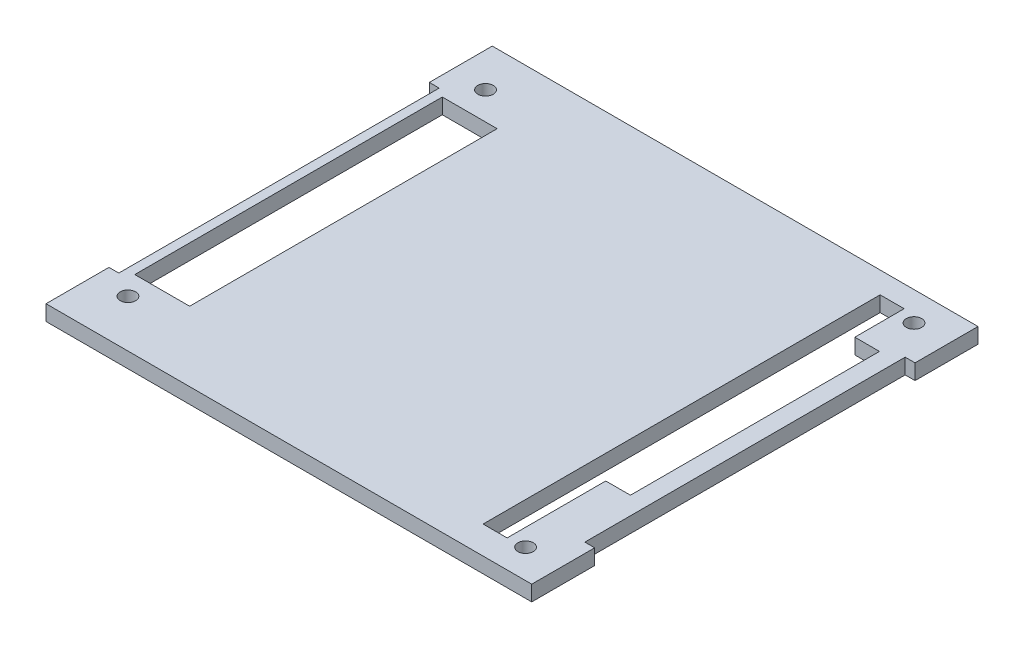
ISO-10303-21;
HEADER;
FILE_DESCRIPTION(('STEP AP214'),'2;1');
FILE_NAME('part.step','',(''),(''),'','','');
FILE_SCHEMA(('AUTOMOTIVE_DESIGN { 1 0 10303 214 1 1 1 1 }'));
ENDSEC;
DATA;
#1=APPLICATION_CONTEXT('core data for automotive mechanical design processes');
#2=APPLICATION_PROTOCOL_DEFINITION('international standard','automotive_design',2000,#1);
#3=PRODUCT_CONTEXT('',#1,'mechanical');
#4=PRODUCT('Part','Part','',(#3));
#5=PRODUCT_RELATED_PRODUCT_CATEGORY('part','',(#4));
#6=PRODUCT_DEFINITION_FORMATION('','',#4);
#7=PRODUCT_DEFINITION_CONTEXT('part definition',#1,'design');
#8=PRODUCT_DEFINITION('design','',#6,#7);
#9=PRODUCT_DEFINITION_SHAPE('','',#8);
#10=(LENGTH_UNIT() NAMED_UNIT(*) SI_UNIT(.MILLI.,.METRE.));
#11=(NAMED_UNIT(*) PLANE_ANGLE_UNIT() SI_UNIT($,.RADIAN.));
#12=(NAMED_UNIT(*) SI_UNIT($,.STERADIAN.) SOLID_ANGLE_UNIT());
#13=UNCERTAINTY_MEASURE_WITH_UNIT(LENGTH_MEASURE(1.E-05),#10,'distance_accuracy_value','');
#14=(GEOMETRIC_REPRESENTATION_CONTEXT(3) GLOBAL_UNCERTAINTY_ASSIGNED_CONTEXT((#13)) GLOBAL_UNIT_ASSIGNED_CONTEXT((#10,
#11,#12)) REPRESENTATION_CONTEXT('',''));
#15=CARTESIAN_POINT('',(0.,0.,0.));
#16=DIRECTION('',(0.,0.,1.));
#17=DIRECTION('',(1.,0.,0.));
#18=AXIS2_PLACEMENT_3D('',#15,#16,#17);
#19=CARTESIAN_POINT('',(0.,1.5875,0.));
#20=DIRECTION('',(0.,1.,0.));
#21=DIRECTION('',(0.,0.,1.));
#22=AXIS2_PLACEMENT_3D('',#19,#20,#21);
#23=PLANE('',#22);
#24=CARTESIAN_POINT('',(40.77835,1.5875,-40.005));
#25=DIRECTION('',(0.,1.,0.));
#26=DIRECTION('',(0.,0.,1.));
#27=AXIS2_PLACEMENT_3D('',#24,#25,#26);
#28=CIRCLE('',#27,1.59);
#29=CARTESIAN_POINT('',(40.77835,1.5875,-38.415));
#30=VERTEX_POINT('',#29);
#31=EDGE_CURVE('E839',#30,#30,#28,.T.);
#32=ORIENTED_EDGE('',*,*,#31,.F.);
#33=EDGE_LOOP('',(#32));
#34=FACE_BOUND('',#33,.T.);
#35=CARTESIAN_POINT('',(40.77835,1.5875,40.005));
#36=DIRECTION('',(0.,1.,0.));
#37=DIRECTION('',(0.,0.,1.));
#38=AXIS2_PLACEMENT_3D('',#35,#36,#37);
#39=CIRCLE('',#38,1.59);
#40=CARTESIAN_POINT('',(40.77835,1.5875,41.595));
#41=VERTEX_POINT('',#40);
#42=EDGE_CURVE('E843',#41,#41,#39,.T.);
#43=ORIENTED_EDGE('',*,*,#42,.F.);
#44=EDGE_LOOP('',(#43));
#45=FACE_BOUND('',#44,.T.);
#46=DIRECTION('',(1.,0.,0.));
#47=VECTOR('',#46,1.);
#48=CARTESIAN_POINT('',(0.,1.5875,40.255));
#49=LINE('',#48,#47);
#50=CARTESIAN_POINT('',(32.26835,1.5875,40.255));
#51=VERTEX_POINT('',#50);
#52=CARTESIAN_POINT('',(37.21835,1.5875,40.255));
#53=VERTEX_POINT('',#52);
#54=EDGE_CURVE('E141',#51,#53,#49,.T.);
#55=ORIENTED_EDGE('',*,*,#54,.F.);
#56=DIRECTION('',(0.,0.,1.));
#57=VECTOR('',#56,1.);
#58=CARTESIAN_POINT('',(32.26835,1.5875,0.));
#59=LINE('',#58,#57);
#60=CARTESIAN_POINT('',(32.26835,1.5875,-41.535));
#61=VERTEX_POINT('',#60);
#62=EDGE_CURVE('E858',#61,#51,#59,.T.);
#63=ORIENTED_EDGE('',*,*,#62,.F.);
#64=DIRECTION('',(-1.,0.,0.));
#65=VECTOR('',#64,1.);
#66=CARTESIAN_POINT('',(0.,1.5875,-41.535));
#67=LINE('',#66,#65);
#68=CARTESIAN_POINT('',(37.21835,1.5875,-41.535));
#69=VERTEX_POINT('',#68);
#70=EDGE_CURVE('E868',#69,#61,#67,.T.);
#71=ORIENTED_EDGE('',*,*,#70,.F.);
#72=DIRECTION('',(0.,0.,-1.));
#73=VECTOR('',#72,1.);
#74=CARTESIAN_POINT('',(37.21835,1.5875,0.));
#75=LINE('',#74,#73);
#76=CARTESIAN_POINT('',(37.21835,1.5875,-31.375));
#77=VERTEX_POINT('',#76);
#78=EDGE_CURVE('E871',#77,#69,#75,.T.);
#79=ORIENTED_EDGE('',*,*,#78,.F.);
#80=DIRECTION('',(-1.,0.,0.));
#81=VECTOR('',#80,1.);
#82=CARTESIAN_POINT('',(0.,1.5875,-31.375));
#83=LINE('',#82,#81);
#84=CARTESIAN_POINT('',(42.29835,1.5875,-31.375));
#85=VERTEX_POINT('',#84);
#86=EDGE_CURVE('E874',#85,#77,#83,.T.);
#87=ORIENTED_EDGE('',*,*,#86,.F.);
#88=DIRECTION('',(0.,0.,-1.));
#89=VECTOR('',#88,1.);
#90=CARTESIAN_POINT('',(42.29835,1.5875,0.));
#91=LINE('',#90,#89);
#92=CARTESIAN_POINT('',(42.29835,1.5875,19.935));
#93=VERTEX_POINT('',#92);
#94=EDGE_CURVE('E877',#93,#85,#91,.T.);
#95=ORIENTED_EDGE('',*,*,#94,.F.);
#96=DIRECTION('',(1.,0.,0.));
#97=VECTOR('',#96,1.);
#98=CARTESIAN_POINT('',(0.,1.5875,19.935));
#99=LINE('',#98,#97);
#100=CARTESIAN_POINT('',(37.21835,1.5875,19.935));
#101=VERTEX_POINT('',#100);
#102=EDGE_CURVE('E306',#101,#93,#99,.T.);
#103=ORIENTED_EDGE('',*,*,#102,.F.);
#104=DIRECTION('',(0.,0.,-1.));
#105=VECTOR('',#104,1.);
#106=CARTESIAN_POINT('',(37.21835,1.5875,0.));
#107=LINE('',#106,#105);
#108=EDGE_CURVE('E880',#53,#101,#107,.T.);
#109=ORIENTED_EDGE('',*,*,#108,.F.);
#110=EDGE_LOOP('',(#55,#63,#71,#79,#87,#95,#103,#109));
#111=FACE_BOUND('',#110,.T.);
#112=CARTESIAN_POINT('',(-44.95165,1.5875,-37.465));
#113=DIRECTION('',(0.,1.,0.));
#114=DIRECTION('',(0.,0.,1.));
#115=AXIS2_PLACEMENT_3D('',#112,#113,#114);
#116=CIRCLE('',#115,1.59);
#117=CARTESIAN_POINT('',(-44.95165,1.5875,-35.875));
#118=VERTEX_POINT('',#117);
#119=EDGE_CURVE('E336',#118,#118,#116,.T.);
#120=ORIENTED_EDGE('',*,*,#119,.F.);
#121=EDGE_LOOP('',(#120));
#122=FACE_BOUND('',#121,.T.);
#123=CARTESIAN_POINT('',(-44.95165,1.5875,36.195));
#124=DIRECTION('',(0.,1.,0.));
#125=DIRECTION('',(0.,0.,1.));
#126=AXIS2_PLACEMENT_3D('',#123,#124,#125);
#127=CIRCLE('',#126,1.59);
#128=CARTESIAN_POINT('',(-44.95165,1.5875,37.785));
#129=VERTEX_POINT('',#128);
#130=EDGE_CURVE('E845',#129,#129,#127,.T.);
#131=ORIENTED_EDGE('',*,*,#130,.F.);
#132=EDGE_LOOP('',(#131));
#133=FACE_BOUND('',#132,.T.);
#134=DIRECTION('',(1.,0.,0.));
#135=VECTOR('',#134,1.);
#136=CARTESIAN_POINT('',(0.,1.5875,-45.9682931399924));
#137=LINE('',#136,#135);
#138=CARTESIAN_POINT('',(-52.06365,1.5875,-45.9682931399924));
#139=VERTEX_POINT('',#138);
#140=CARTESIAN_POINT('',(48.00035,1.5875,-45.9682931399924));
#141=VERTEX_POINT('',#140);
#142=EDGE_CURVE('E353',#139,#141,#137,.T.);
#143=ORIENTED_EDGE('',*,*,#142,.F.);
#144=DIRECTION('',(0.,0.,1.));
#145=VECTOR('',#144,1.);
#146=CARTESIAN_POINT('',(-52.06365,1.5875,0.));
#147=LINE('',#146,#145);
#148=CARTESIAN_POINT('',(-52.06365,1.5875,-33.0002931399924));
#149=VERTEX_POINT('',#148);
#150=EDGE_CURVE('E356',#139,#149,#147,.T.);
#151=ORIENTED_EDGE('',*,*,#150,.T.);
#152=DIRECTION('',(1.,0.,0.));
#153=VECTOR('',#152,1.);
#154=CARTESIAN_POINT('',(0.,1.5875,-33.0002931399924));
#155=LINE('',#154,#153);
#156=CARTESIAN_POINT('',(-50.03165,1.5875,-33.0002931399924));
#157=VERTEX_POINT('',#156);
#158=EDGE_CURVE('E359',#149,#157,#155,.T.);
#159=ORIENTED_EDGE('',*,*,#158,.T.);
#160=DIRECTION('',(0.,0.,-1.));
#161=VECTOR('',#160,1.);
#162=CARTESIAN_POINT('',(-50.03165,1.5875,0.));
#163=LINE('',#162,#161);
#164=CARTESIAN_POINT('',(-50.03165,1.5875,32.9997068600076));
#165=VERTEX_POINT('',#164);
#166=EDGE_CURVE('E361',#165,#157,#163,.T.);
#167=ORIENTED_EDGE('',*,*,#166,.F.);
#168=DIRECTION('',(-1.,0.,0.));
#169=VECTOR('',#168,1.);
#170=CARTESIAN_POINT('',(0.,1.5875,32.9997068600076));
#171=LINE('',#170,#169);
#172=CARTESIAN_POINT('',(-52.06365,1.5875,32.9997068600076));
#173=VERTEX_POINT('',#172);
#174=EDGE_CURVE('E364',#165,#173,#171,.T.);
#175=ORIENTED_EDGE('',*,*,#174,.T.);
#176=DIRECTION('',(0.,0.,1.));
#177=VECTOR('',#176,1.);
#178=CARTESIAN_POINT('',(-52.06365,1.5875,0.));
#179=LINE('',#178,#177);
#180=CARTESIAN_POINT('',(-52.06365,1.5875,45.9677068600076));
#181=VERTEX_POINT('',#180);
#182=EDGE_CURVE('E366',#173,#181,#179,.T.);
#183=ORIENTED_EDGE('',*,*,#182,.T.);
#184=DIRECTION('',(1.,0.,0.));
#185=VECTOR('',#184,1.);
#186=CARTESIAN_POINT('',(0.,1.5875,45.9677068600076));
#187=LINE('',#186,#185);
#188=CARTESIAN_POINT('',(48.00035,1.5875,45.9677068600076));
#189=VERTEX_POINT('',#188);
#190=EDGE_CURVE('E368',#181,#189,#187,.T.);
#191=ORIENTED_EDGE('',*,*,#190,.T.);
#192=DIRECTION('',(0.,0.,-1.));
#193=VECTOR('',#192,1.);
#194=CARTESIAN_POINT('',(48.00035,1.5875,0.));
#195=LINE('',#194,#193);
#196=CARTESIAN_POINT('',(48.00035,1.5875,32.9997068600076));
#197=VERTEX_POINT('',#196);
#198=EDGE_CURVE('E370',#189,#197,#195,.T.);
#199=ORIENTED_EDGE('',*,*,#198,.T.);
#200=DIRECTION('',(-1.,0.,0.));
#201=VECTOR('',#200,1.);
#202=CARTESIAN_POINT('',(0.,1.5875,32.9997068600076));
#203=LINE('',#202,#201);
#204=CARTESIAN_POINT('',(45.96835,1.5875,32.9997068600076));
#205=VERTEX_POINT('',#204);
#206=EDGE_CURVE('E372',#197,#205,#203,.T.);
#207=ORIENTED_EDGE('',*,*,#206,.T.);
#208=DIRECTION('',(0.,0.,-1.));
#209=VECTOR('',#208,1.);
#210=CARTESIAN_POINT('',(45.96835,1.5875,0.));
#211=LINE('',#210,#209);
#212=CARTESIAN_POINT('',(45.96835,1.5875,-33.0002931399924));
#213=VERTEX_POINT('',#212);
#214=EDGE_CURVE('E374',#205,#213,#211,.T.);
#215=ORIENTED_EDGE('',*,*,#214,.T.);
#216=DIRECTION('',(1.,0.,0.));
#217=VECTOR('',#216,1.);
#218=CARTESIAN_POINT('',(0.,1.5875,-33.0002931399924));
#219=LINE('',#218,#217);
#220=CARTESIAN_POINT('',(48.00035,1.5875,-33.0002931399924));
#221=VERTEX_POINT('',#220);
#222=EDGE_CURVE('E376',#213,#221,#219,.T.);
#223=ORIENTED_EDGE('',*,*,#222,.T.);
#224=DIRECTION('',(0.,0.,-1.));
#225=VECTOR('',#224,1.);
#226=CARTESIAN_POINT('',(48.00035,1.5875,0.));
#227=LINE('',#226,#225);
#228=EDGE_CURVE('E378',#221,#141,#227,.T.);
#229=ORIENTED_EDGE('',*,*,#228,.T.);
#230=EDGE_LOOP('',(#143,#151,#159,#167,#175,#183,#191,#199,#207,#215,#223,#229));
#231=FACE_BOUND('',#230,.T.);
#232=DIRECTION('',(-1.,0.,0.));
#233=VECTOR('',#232,1.);
#234=CARTESIAN_POINT('',(0.,1.5875,31.62));
#235=LINE('',#234,#233);
#236=CARTESIAN_POINT('',(-36.82165,1.5875,31.62));
#237=VERTEX_POINT('',#236);
#238=CARTESIAN_POINT('',(-48.12165,1.5875,31.62));
#239=VERTEX_POINT('',#238);
#240=EDGE_CURVE('E339',#237,#239,#235,.T.);
#241=ORIENTED_EDGE('',*,*,#240,.T.);
#242=DIRECTION('',(0.,0.,-1.));
#243=VECTOR('',#242,1.);
#244=CARTESIAN_POINT('',(-48.12165,1.5875,0.));
#245=LINE('',#244,#243);
#246=CARTESIAN_POINT('',(-48.12165,1.5875,-31.73));
#247=VERTEX_POINT('',#246);
#248=EDGE_CURVE('E335',#239,#247,#245,.T.);
#249=ORIENTED_EDGE('',*,*,#248,.T.);
#250=DIRECTION('',(1.,0.,0.));
#251=VECTOR('',#250,1.);
#252=CARTESIAN_POINT('',(0.,1.5875,-31.73));
#253=LINE('',#252,#251);
#254=CARTESIAN_POINT('',(-36.82165,1.5875,-31.73));
#255=VERTEX_POINT('',#254);
#256=EDGE_CURVE('E332',#247,#255,#253,.T.);
#257=ORIENTED_EDGE('',*,*,#256,.T.);
#258=DIRECTION('',(0.,0.,1.));
#259=VECTOR('',#258,1.);
#260=CARTESIAN_POINT('',(-36.82165,1.5875,0.));
#261=LINE('',#260,#259);
#262=EDGE_CURVE('E149',#255,#237,#261,.T.);
#263=ORIENTED_EDGE('',*,*,#262,.T.);
#264=EDGE_LOOP('',(#241,#249,#257,#263));
#265=FACE_BOUND('',#264,.T.);
#266=ADVANCED_FACE('F126',(#34,#45,#111,#122,#133,#231,#265),#23,.T.);
#267=CARTESIAN_POINT('',(0.,-1.5875,0.));
#268=DIRECTION('',(0.,1.,0.));
#269=DIRECTION('',(0.,0.,1.));
#270=AXIS2_PLACEMENT_3D('',#267,#268,#269);
#271=PLANE('',#270);
#272=CARTESIAN_POINT('',(40.77835,-1.58750000000001,-40.005));
#273=DIRECTION('',(0.,1.,0.));
#274=DIRECTION('',(0.,0.,1.));
#275=AXIS2_PLACEMENT_3D('',#272,#273,#274);
#276=CIRCLE('',#275,1.59);
#277=CARTESIAN_POINT('',(40.77835,-1.58750000000001,-38.415));
#278=VERTEX_POINT('',#277);
#279=EDGE_CURVE('E837',#278,#278,#276,.F.);
#280=ORIENTED_EDGE('',*,*,#279,.F.);
#281=EDGE_LOOP('',(#280));
#282=FACE_BOUND('',#281,.T.);
#283=CARTESIAN_POINT('',(40.77835,-1.58750000000001,40.005));
#284=DIRECTION('',(0.,1.,0.));
#285=DIRECTION('',(0.,0.,1.));
#286=AXIS2_PLACEMENT_3D('',#283,#284,#285);
#287=CIRCLE('',#286,1.59);
#288=CARTESIAN_POINT('',(40.77835,-1.58750000000001,41.595));
#289=VERTEX_POINT('',#288);
#290=EDGE_CURVE('E840',#289,#289,#287,.F.);
#291=ORIENTED_EDGE('',*,*,#290,.F.);
#292=EDGE_LOOP('',(#291));
#293=FACE_BOUND('',#292,.T.);
#294=DIRECTION('',(0.,0.,-1.));
#295=VECTOR('',#294,1.);
#296=CARTESIAN_POINT('',(32.26835,-1.58750000000001,0.));
#297=LINE('',#296,#295);
#298=CARTESIAN_POINT('',(32.26835,-1.58750000000001,40.255));
#299=VERTEX_POINT('',#298);
#300=CARTESIAN_POINT('',(32.26835,-1.58750000000001,-41.535));
#301=VERTEX_POINT('',#300);
#302=EDGE_CURVE('E885',#299,#301,#297,.T.);
#303=ORIENTED_EDGE('',*,*,#302,.F.);
#304=DIRECTION('',(-1.,0.,0.));
#305=VECTOR('',#304,1.);
#306=CARTESIAN_POINT('',(0.,-1.58750000000001,40.255));
#307=LINE('',#306,#305);
#308=CARTESIAN_POINT('',(37.21835,-1.58750000000001,40.255));
#309=VERTEX_POINT('',#308);
#310=EDGE_CURVE('E855',#309,#299,#307,.T.);
#311=ORIENTED_EDGE('',*,*,#310,.F.);
#312=DIRECTION('',(0.,0.,1.));
#313=VECTOR('',#312,1.);
#314=CARTESIAN_POINT('',(37.21835,-1.58750000000001,0.));
#315=LINE('',#314,#313);
#316=CARTESIAN_POINT('',(37.21835,-1.5875,19.935));
#317=VERTEX_POINT('',#316);
#318=EDGE_CURVE('E314',#317,#309,#315,.T.);
#319=ORIENTED_EDGE('',*,*,#318,.F.);
#320=DIRECTION('',(-1.,0.,0.));
#321=VECTOR('',#320,1.);
#322=CARTESIAN_POINT('',(0.,-1.58750000000001,19.935));
#323=LINE('',#322,#321);
#324=CARTESIAN_POINT('',(42.29835,-1.58750000000001,19.935));
#325=VERTEX_POINT('',#324);
#326=EDGE_CURVE('E298',#325,#317,#323,.T.);
#327=ORIENTED_EDGE('',*,*,#326,.F.);
#328=DIRECTION('',(0.,0.,1.));
#329=VECTOR('',#328,1.);
#330=CARTESIAN_POINT('',(42.29835,-1.58750000000001,0.));
#331=LINE('',#330,#329);
#332=CARTESIAN_POINT('',(42.29835,-1.58750000000001,-31.375));
#333=VERTEX_POINT('',#332);
#334=EDGE_CURVE('E288',#333,#325,#331,.T.);
#335=ORIENTED_EDGE('',*,*,#334,.F.);
#336=DIRECTION('',(1.,0.,0.));
#337=VECTOR('',#336,1.);
#338=CARTESIAN_POINT('',(0.,-1.58750000000001,-31.375));
#339=LINE('',#338,#337);
#340=CARTESIAN_POINT('',(37.21835,-1.58750000000001,-31.375));
#341=VERTEX_POINT('',#340);
#342=EDGE_CURVE('E299',#341,#333,#339,.T.);
#343=ORIENTED_EDGE('',*,*,#342,.F.);
#344=DIRECTION('',(0.,0.,1.));
#345=VECTOR('',#344,1.);
#346=CARTESIAN_POINT('',(37.21835,-1.58750000000001,0.));
#347=LINE('',#346,#345);
#348=CARTESIAN_POINT('',(37.21835,-1.58750000000001,-41.535));
#349=VERTEX_POINT('',#348);
#350=EDGE_CURVE('E889',#349,#341,#347,.T.);
#351=ORIENTED_EDGE('',*,*,#350,.F.);
#352=DIRECTION('',(1.,0.,0.));
#353=VECTOR('',#352,1.);
#354=CARTESIAN_POINT('',(0.,-1.58750000000001,-41.535));
#355=LINE('',#354,#353);
#356=EDGE_CURVE('E887',#301,#349,#355,.T.);
#357=ORIENTED_EDGE('',*,*,#356,.F.);
#358=EDGE_LOOP('',(#303,#311,#319,#327,#335,#343,#351,#357));
#359=FACE_BOUND('',#358,.T.);
#360=CARTESIAN_POINT('',(-44.95165,-1.58750000000001,-37.465));
#361=DIRECTION('',(0.,1.,0.));
#362=DIRECTION('',(0.,0.,1.));
#363=AXIS2_PLACEMENT_3D('',#360,#361,#362);
#364=CIRCLE('',#363,1.59);
#365=CARTESIAN_POINT('',(-44.95165,-1.58750000000001,-35.875));
#366=VERTEX_POINT('',#365);
#367=EDGE_CURVE('E849',#366,#366,#364,.F.);
#368=ORIENTED_EDGE('',*,*,#367,.F.);
#369=EDGE_LOOP('',(#368));
#370=FACE_BOUND('',#369,.T.);
#371=CARTESIAN_POINT('',(-44.95165,-1.58750000000001,36.195));
#372=DIRECTION('',(0.,1.,0.));
#373=DIRECTION('',(0.,0.,1.));
#374=AXIS2_PLACEMENT_3D('',#371,#372,#373);
#375=CIRCLE('',#374,1.59);
#376=CARTESIAN_POINT('',(-44.95165,-1.58750000000001,37.785));
#377=VERTEX_POINT('',#376);
#378=EDGE_CURVE('E908',#377,#377,#375,.F.);
#379=ORIENTED_EDGE('',*,*,#378,.F.);
#380=EDGE_LOOP('',(#379));
#381=FACE_BOUND('',#380,.T.);
#382=DIRECTION('',(1.,0.,0.));
#383=VECTOR('',#382,1.);
#384=CARTESIAN_POINT('',(0.,-1.5875,-45.9682931399924));
#385=LINE('',#384,#383);
#386=CARTESIAN_POINT('',(-52.06365,-1.5875,-45.9682931399924));
#387=VERTEX_POINT('',#386);
#388=CARTESIAN_POINT('',(48.00035,-1.5875,-45.9682931399924));
#389=VERTEX_POINT('',#388);
#390=EDGE_CURVE('E331',#387,#389,#385,.T.);
#391=ORIENTED_EDGE('',*,*,#390,.T.);
#392=DIRECTION('',(0.,0.,-1.));
#393=VECTOR('',#392,1.);
#394=CARTESIAN_POINT('',(48.00035,-1.5875,0.));
#395=LINE('',#394,#393);
#396=CARTESIAN_POINT('',(48.00035,-1.5875,-33.0002931399924));
#397=VERTEX_POINT('',#396);
#398=EDGE_CURVE('E357',#397,#389,#395,.T.);
#399=ORIENTED_EDGE('',*,*,#398,.F.);
#400=DIRECTION('',(1.,0.,0.));
#401=VECTOR('',#400,1.);
#402=CARTESIAN_POINT('',(0.,-1.5875,-33.0002931399924));
#403=LINE('',#402,#401);
#404=CARTESIAN_POINT('',(45.96835,-1.5875,-33.0002931399924));
#405=VERTEX_POINT('',#404);
#406=EDGE_CURVE('E403',#405,#397,#403,.T.);
#407=ORIENTED_EDGE('',*,*,#406,.F.);
#408=DIRECTION('',(0.,0.,-1.));
#409=VECTOR('',#408,1.);
#410=CARTESIAN_POINT('',(45.96835,-1.5875,0.));
#411=LINE('',#410,#409);
#412=CARTESIAN_POINT('',(45.96835,-1.5875,32.9997068600076));
#413=VERTEX_POINT('',#412);
#414=EDGE_CURVE('E401',#413,#405,#411,.T.);
#415=ORIENTED_EDGE('',*,*,#414,.F.);
#416=DIRECTION('',(-1.,0.,0.));
#417=VECTOR('',#416,1.);
#418=CARTESIAN_POINT('',(0.,-1.5875,32.9997068600076));
#419=LINE('',#418,#417);
#420=CARTESIAN_POINT('',(48.00035,-1.5875,32.9997068600076));
#421=VERTEX_POINT('',#420);
#422=EDGE_CURVE('E399',#421,#413,#419,.T.);
#423=ORIENTED_EDGE('',*,*,#422,.F.);
#424=DIRECTION('',(0.,0.,-1.));
#425=VECTOR('',#424,1.);
#426=CARTESIAN_POINT('',(48.00035,-1.5875,0.));
#427=LINE('',#426,#425);
#428=CARTESIAN_POINT('',(48.00035,-1.5875,45.9677068600076));
#429=VERTEX_POINT('',#428);
#430=EDGE_CURVE('E397',#429,#421,#427,.T.);
#431=ORIENTED_EDGE('',*,*,#430,.F.);
#432=DIRECTION('',(1.,0.,0.));
#433=VECTOR('',#432,1.);
#434=CARTESIAN_POINT('',(0.,-1.5875,45.9677068600076));
#435=LINE('',#434,#433);
#436=CARTESIAN_POINT('',(-52.06365,-1.5875,45.9677068600076));
#437=VERTEX_POINT('',#436);
#438=EDGE_CURVE('E395',#437,#429,#435,.T.);
#439=ORIENTED_EDGE('',*,*,#438,.F.);
#440=DIRECTION('',(0.,0.,1.));
#441=VECTOR('',#440,1.);
#442=CARTESIAN_POINT('',(-52.06365,-1.5875,0.));
#443=LINE('',#442,#441);
#444=CARTESIAN_POINT('',(-52.06365,-1.5875,32.9997068600076));
#445=VERTEX_POINT('',#444);
#446=EDGE_CURVE('E393',#445,#437,#443,.T.);
#447=ORIENTED_EDGE('',*,*,#446,.F.);
#448=DIRECTION('',(-1.,0.,0.));
#449=VECTOR('',#448,1.);
#450=CARTESIAN_POINT('',(0.,-1.5875,32.9997068600076));
#451=LINE('',#450,#449);
#452=CARTESIAN_POINT('',(-50.03165,-1.5875,32.9997068600076));
#453=VERTEX_POINT('',#452);
#454=EDGE_CURVE('E391',#453,#445,#451,.T.);
#455=ORIENTED_EDGE('',*,*,#454,.F.);
#456=DIRECTION('',(0.,0.,-1.));
#457=VECTOR('',#456,1.);
#458=CARTESIAN_POINT('',(-50.03165,-1.5875,0.));
#459=LINE('',#458,#457);
#460=CARTESIAN_POINT('',(-50.03165,-1.5875,-33.0002931399924));
#461=VERTEX_POINT('',#460);
#462=EDGE_CURVE('E388',#453,#461,#459,.T.);
#463=ORIENTED_EDGE('',*,*,#462,.T.);
#464=DIRECTION('',(1.,0.,0.));
#465=VECTOR('',#464,1.);
#466=CARTESIAN_POINT('',(0.,-1.5875,-33.0002931399924));
#467=LINE('',#466,#465);
#468=CARTESIAN_POINT('',(-52.06365,-1.5875,-33.0002931399924));
#469=VERTEX_POINT('',#468);
#470=EDGE_CURVE('E385',#469,#461,#467,.T.);
#471=ORIENTED_EDGE('',*,*,#470,.F.);
#472=DIRECTION('',(0.,0.,1.));
#473=VECTOR('',#472,1.);
#474=CARTESIAN_POINT('',(-52.06365,-1.5875,0.));
#475=LINE('',#474,#473);
#476=EDGE_CURVE('E383',#387,#469,#475,.T.);
#477=ORIENTED_EDGE('',*,*,#476,.F.);
#478=EDGE_LOOP('',(#391,#399,#407,#415,#423,#431,#439,#447,#455,#463,#471,#477));
#479=FACE_BOUND('',#478,.T.);
#480=DIRECTION('',(0.,0.,1.));
#481=VECTOR('',#480,1.);
#482=CARTESIAN_POINT('',(-48.12165,-1.58750000000001,0.));
#483=LINE('',#482,#481);
#484=CARTESIAN_POINT('',(-48.12165,-1.5875,-31.73));
#485=VERTEX_POINT('',#484);
#486=CARTESIAN_POINT('',(-48.12165,-1.58750000000001,31.62));
#487=VERTEX_POINT('',#486);
#488=EDGE_CURVE('E325',#485,#487,#483,.T.);
#489=ORIENTED_EDGE('',*,*,#488,.T.);
#490=DIRECTION('',(1.,0.,0.));
#491=VECTOR('',#490,1.);
#492=CARTESIAN_POINT('',(0.,-1.58750000000001,31.62));
#493=LINE('',#492,#491);
#494=CARTESIAN_POINT('',(-36.82165,-1.58750000000001,31.62));
#495=VERTEX_POINT('',#494);
#496=EDGE_CURVE('E321',#487,#495,#493,.T.);
#497=ORIENTED_EDGE('',*,*,#496,.T.);
#498=DIRECTION('',(0.,0.,-1.));
#499=VECTOR('',#498,1.);
#500=CARTESIAN_POINT('',(-36.82165,-1.58750000000001,0.));
#501=LINE('',#500,#499);
#502=CARTESIAN_POINT('',(-36.82165,-1.58750000000001,-31.73));
#503=VERTEX_POINT('',#502);
#504=EDGE_CURVE('E324',#495,#503,#501,.T.);
#505=ORIENTED_EDGE('',*,*,#504,.T.);
#506=DIRECTION('',(-1.,0.,0.));
#507=VECTOR('',#506,1.);
#508=CARTESIAN_POINT('',(0.,-1.58750000000001,-31.73));
#509=LINE('',#508,#507);
#510=EDGE_CURVE('E328',#503,#485,#509,.T.);
#511=ORIENTED_EDGE('',*,*,#510,.T.);
#512=EDGE_LOOP('',(#489,#497,#505,#511));
#513=FACE_BOUND('',#512,.T.);
#514=ADVANCED_FACE('F311',(#282,#293,#359,#370,#381,#479,#513),#271,.F.);
#515=CARTESIAN_POINT('',(0.,1.5875,-45.9682931399924));
#516=DIRECTION('',(0.,0.,-1.));
#517=DIRECTION('',(-1.,0.,0.));
#518=AXIS2_PLACEMENT_3D('',#515,#516,#517);
#519=PLANE('',#518);
#520=ORIENTED_EDGE('',*,*,#390,.F.);
#521=DIRECTION('',(0.,-1.,0.));
#522=VECTOR('',#521,1.);
#523=CARTESIAN_POINT('',(-52.06365,1.5875,-45.9682931399924));
#524=LINE('',#523,#522);
#525=EDGE_CURVE('E12',#139,#387,#524,.T.);
#526=ORIENTED_EDGE('',*,*,#525,.F.);
#527=ORIENTED_EDGE('',*,*,#142,.T.);
#528=DIRECTION('',(0.,-1.,0.));
#529=VECTOR('',#528,1.);
#530=CARTESIAN_POINT('',(48.00035,1.5875,-45.9682931399924));
#531=LINE('',#530,#529);
#532=EDGE_CURVE('E380',#141,#389,#531,.T.);
#533=ORIENTED_EDGE('',*,*,#532,.T.);
#534=EDGE_LOOP('',(#520,#526,#527,#533));
#535=FACE_BOUND('',#534,.T.);
#536=ADVANCED_FACE('F128',(#535),#519,.T.);
#537=CARTESIAN_POINT('',(-52.06365,1.5875,0.));
#538=DIRECTION('',(1.,0.,0.));
#539=DIRECTION('',(0.,0.,-1.));
#540=AXIS2_PLACEMENT_3D('',#537,#538,#539);
#541=PLANE('',#540);
#542=ORIENTED_EDGE('',*,*,#476,.T.);
#543=DIRECTION('',(0.,-1.,0.));
#544=VECTOR('',#543,1.);
#545=CARTESIAN_POINT('',(-52.06365,1.5875,-33.0002931399924));
#546=LINE('',#545,#544);
#547=EDGE_CURVE('E134',#149,#469,#546,.T.);
#548=ORIENTED_EDGE('',*,*,#547,.F.);
#549=ORIENTED_EDGE('',*,*,#150,.F.);
#550=ORIENTED_EDGE('',*,*,#525,.T.);
#551=EDGE_LOOP('',(#542,#548,#549,#550));
#552=FACE_BOUND('',#551,.T.);
#553=ADVANCED_FACE('F456',(#552),#541,.F.);
#554=CARTESIAN_POINT('',(0.,1.5875,-33.0002931399924));
#555=DIRECTION('',(0.,0.,-1.));
#556=DIRECTION('',(-1.,0.,0.));
#557=AXIS2_PLACEMENT_3D('',#554,#555,#556);
#558=PLANE('',#557);
#559=ORIENTED_EDGE('',*,*,#470,.T.);
#560=DIRECTION('',(0.,-1.,0.));
#561=VECTOR('',#560,1.);
#562=CARTESIAN_POINT('',(-50.03165,1.5875,-33.0002931399924));
#563=LINE('',#562,#561);
#564=EDGE_CURVE('E431',#157,#461,#563,.T.);
#565=ORIENTED_EDGE('',*,*,#564,.F.);
#566=ORIENTED_EDGE('',*,*,#158,.F.);
#567=ORIENTED_EDGE('',*,*,#547,.T.);
#568=EDGE_LOOP('',(#559,#565,#566,#567));
#569=FACE_BOUND('',#568,.T.);
#570=ADVANCED_FACE('F437',(#569),#558,.F.);
#571=CARTESIAN_POINT('',(-50.03165,1.5875,0.));
#572=DIRECTION('',(-1.,0.,0.));
#573=DIRECTION('',(0.,0.,1.));
#574=AXIS2_PLACEMENT_3D('',#571,#572,#573);
#575=PLANE('',#574);
#576=ORIENTED_EDGE('',*,*,#462,.F.);
#577=DIRECTION('',(0.,-1.,0.));
#578=VECTOR('',#577,1.);
#579=CARTESIAN_POINT('',(-50.03165,1.5875,32.9997068600076));
#580=LINE('',#579,#578);
#581=EDGE_CURVE('E429',#165,#453,#580,.T.);
#582=ORIENTED_EDGE('',*,*,#581,.F.);
#583=ORIENTED_EDGE('',*,*,#166,.T.);
#584=ORIENTED_EDGE('',*,*,#564,.T.);
#585=EDGE_LOOP('',(#576,#582,#583,#584));
#586=FACE_BOUND('',#585,.T.);
#587=ADVANCED_FACE('F449',(#586),#575,.T.);
#588=CARTESIAN_POINT('',(0.,1.5875,32.9997068600076));
#589=DIRECTION('',(0.,0.,1.));
#590=DIRECTION('',(1.,0.,0.));
#591=AXIS2_PLACEMENT_3D('',#588,#589,#590);
#592=PLANE('',#591);
#593=ORIENTED_EDGE('',*,*,#454,.T.);
#594=DIRECTION('',(0.,-1.,0.));
#595=VECTOR('',#594,1.);
#596=CARTESIAN_POINT('',(-52.06365,1.5875,32.9997068600076));
#597=LINE('',#596,#595);
#598=EDGE_CURVE('E426',#173,#445,#597,.T.);
#599=ORIENTED_EDGE('',*,*,#598,.F.);
#600=ORIENTED_EDGE('',*,*,#174,.F.);
#601=ORIENTED_EDGE('',*,*,#581,.T.);
#602=EDGE_LOOP('',(#593,#599,#600,#601));
#603=FACE_BOUND('',#602,.T.);
#604=ADVANCED_FACE('F493',(#603),#592,.F.);
#605=CARTESIAN_POINT('',(-52.06365,1.5875,0.));
#606=DIRECTION('',(1.,0.,0.));
#607=DIRECTION('',(0.,0.,-1.));
#608=AXIS2_PLACEMENT_3D('',#605,#606,#607);
#609=PLANE('',#608);
#610=ORIENTED_EDGE('',*,*,#446,.T.);
#611=DIRECTION('',(0.,-1.,0.));
#612=VECTOR('',#611,1.);
#613=CARTESIAN_POINT('',(-52.06365,1.5875,45.9677068600076));
#614=LINE('',#613,#612);
#615=EDGE_CURVE('E423',#181,#437,#614,.T.);
#616=ORIENTED_EDGE('',*,*,#615,.F.);
#617=ORIENTED_EDGE('',*,*,#182,.F.);
#618=ORIENTED_EDGE('',*,*,#598,.T.);
#619=EDGE_LOOP('',(#610,#616,#617,#618));
#620=FACE_BOUND('',#619,.T.);
#621=ADVANCED_FACE('F490',(#620),#609,.F.);
#622=CARTESIAN_POINT('',(0.,1.5875,45.9677068600076));
#623=DIRECTION('',(0.,0.,-1.));
#624=DIRECTION('',(-1.,0.,0.));
#625=AXIS2_PLACEMENT_3D('',#622,#623,#624);
#626=PLANE('',#625);
#627=ORIENTED_EDGE('',*,*,#438,.T.);
#628=DIRECTION('',(0.,-1.,0.));
#629=VECTOR('',#628,1.);
#630=CARTESIAN_POINT('',(48.00035,1.5875,45.9677068600076));
#631=LINE('',#630,#629);
#632=EDGE_CURVE('E420',#189,#429,#631,.T.);
#633=ORIENTED_EDGE('',*,*,#632,.F.);
#634=ORIENTED_EDGE('',*,*,#190,.F.);
#635=ORIENTED_EDGE('',*,*,#615,.T.);
#636=EDGE_LOOP('',(#627,#633,#634,#635));
#637=FACE_BOUND('',#636,.T.);
#638=ADVANCED_FACE('F487',(#637),#626,.F.);
#639=CARTESIAN_POINT('',(48.00035,1.5875,0.));
#640=DIRECTION('',(-1.,0.,0.));
#641=DIRECTION('',(0.,0.,1.));
#642=AXIS2_PLACEMENT_3D('',#639,#640,#641);
#643=PLANE('',#642);
#644=ORIENTED_EDGE('',*,*,#430,.T.);
#645=DIRECTION('',(0.,-1.,0.));
#646=VECTOR('',#645,1.);
#647=CARTESIAN_POINT('',(48.00035,1.5875,32.9997068600076));
#648=LINE('',#647,#646);
#649=EDGE_CURVE('E417',#197,#421,#648,.T.);
#650=ORIENTED_EDGE('',*,*,#649,.F.);
#651=ORIENTED_EDGE('',*,*,#198,.F.);
#652=ORIENTED_EDGE('',*,*,#632,.T.);
#653=EDGE_LOOP('',(#644,#650,#651,#652));
#654=FACE_BOUND('',#653,.T.);
#655=ADVANCED_FACE('F483',(#654),#643,.F.);
#656=CARTESIAN_POINT('',(0.,1.5875,32.9997068600076));
#657=DIRECTION('',(0.,0.,1.));
#658=DIRECTION('',(1.,0.,0.));
#659=AXIS2_PLACEMENT_3D('',#656,#657,#658);
#660=PLANE('',#659);
#661=ORIENTED_EDGE('',*,*,#422,.T.);
#662=DIRECTION('',(0.,-1.,0.));
#663=VECTOR('',#662,1.);
#664=CARTESIAN_POINT('',(45.96835,1.5875,32.9997068600076));
#665=LINE('',#664,#663);
#666=EDGE_CURVE('E414',#205,#413,#665,.T.);
#667=ORIENTED_EDGE('',*,*,#666,.F.);
#668=ORIENTED_EDGE('',*,*,#206,.F.);
#669=ORIENTED_EDGE('',*,*,#649,.T.);
#670=EDGE_LOOP('',(#661,#667,#668,#669));
#671=FACE_BOUND('',#670,.T.);
#672=ADVANCED_FACE('F478',(#671),#660,.F.);
#673=CARTESIAN_POINT('',(45.96835,1.5875,0.));
#674=DIRECTION('',(-1.,0.,0.));
#675=DIRECTION('',(0.,0.,1.));
#676=AXIS2_PLACEMENT_3D('',#673,#674,#675);
#677=PLANE('',#676);
#678=ORIENTED_EDGE('',*,*,#414,.T.);
#679=DIRECTION('',(0.,-1.,0.));
#680=VECTOR('',#679,1.);
#681=CARTESIAN_POINT('',(45.96835,1.5875,-33.0002931399924));
#682=LINE('',#681,#680);
#683=EDGE_CURVE('E411',#213,#405,#682,.T.);
#684=ORIENTED_EDGE('',*,*,#683,.F.);
#685=ORIENTED_EDGE('',*,*,#214,.F.);
#686=ORIENTED_EDGE('',*,*,#666,.T.);
#687=EDGE_LOOP('',(#678,#684,#685,#686));
#688=FACE_BOUND('',#687,.T.);
#689=ADVANCED_FACE('F472',(#688),#677,.F.);
#690=CARTESIAN_POINT('',(0.,1.5875,-33.0002931399924));
#691=DIRECTION('',(0.,0.,-1.));
#692=DIRECTION('',(-1.,0.,0.));
#693=AXIS2_PLACEMENT_3D('',#690,#691,#692);
#694=PLANE('',#693);
#695=ORIENTED_EDGE('',*,*,#406,.T.);
#696=DIRECTION('',(0.,-1.,0.));
#697=VECTOR('',#696,1.);
#698=CARTESIAN_POINT('',(48.00035,1.5875,-33.0002931399924));
#699=LINE('',#698,#697);
#700=EDGE_CURVE('E408',#221,#397,#699,.T.);
#701=ORIENTED_EDGE('',*,*,#700,.F.);
#702=ORIENTED_EDGE('',*,*,#222,.F.);
#703=ORIENTED_EDGE('',*,*,#683,.T.);
#704=EDGE_LOOP('',(#695,#701,#702,#703));
#705=FACE_BOUND('',#704,.T.);
#706=ADVANCED_FACE('F468',(#705),#694,.F.);
#707=CARTESIAN_POINT('',(48.00035,1.5875,0.));
#708=DIRECTION('',(-1.,0.,0.));
#709=DIRECTION('',(0.,0.,1.));
#710=AXIS2_PLACEMENT_3D('',#707,#708,#709);
#711=PLANE('',#710);
#712=ORIENTED_EDGE('',*,*,#398,.T.);
#713=ORIENTED_EDGE('',*,*,#532,.F.);
#714=ORIENTED_EDGE('',*,*,#228,.F.);
#715=ORIENTED_EDGE('',*,*,#700,.T.);
#716=EDGE_LOOP('',(#712,#713,#714,#715));
#717=FACE_BOUND('',#716,.T.);
#718=ADVANCED_FACE('F463',(#717),#711,.F.);
#719=CARTESIAN_POINT('',(-48.12165,-83.9902001984765,0.));
#720=DIRECTION('',(1.,0.,0.));
#721=DIRECTION('',(0.,0.,-1.));
#722=AXIS2_PLACEMENT_3D('',#719,#720,#721);
#723=PLANE('',#722);
#724=DIRECTION('',(0.,1.,0.));
#725=VECTOR('',#724,1.);
#726=CARTESIAN_POINT('',(-48.12165,-83.9902001984765,-31.73));
#727=LINE('',#726,#725);
#728=EDGE_CURVE('E343',#485,#247,#727,.T.);
#729=ORIENTED_EDGE('',*,*,#728,.T.);
#730=ORIENTED_EDGE('',*,*,#248,.F.);
#731=DIRECTION('',(0.,1.,0.));
#732=VECTOR('',#731,1.);
#733=CARTESIAN_POINT('',(-48.12165,-83.9902001984765,31.62));
#734=LINE('',#733,#732);
#735=EDGE_CURVE('E348',#487,#239,#734,.T.);
#736=ORIENTED_EDGE('',*,*,#735,.F.);
#737=ORIENTED_EDGE('',*,*,#488,.F.);
#738=EDGE_LOOP('',(#729,#730,#736,#737));
#739=FACE_BOUND('',#738,.T.);
#740=ADVANCED_FACE('F518',(#739),#723,.T.);
#741=CARTESIAN_POINT('',(0.,-83.9902001984765,31.62));
#742=DIRECTION('',(0.,0.,-1.));
#743=DIRECTION('',(-1.,0.,0.));
#744=AXIS2_PLACEMENT_3D('',#741,#742,#743);
#745=PLANE('',#744);
#746=ORIENTED_EDGE('',*,*,#735,.T.);
#747=ORIENTED_EDGE('',*,*,#240,.F.);
#748=DIRECTION('',(0.,1.,0.));
#749=VECTOR('',#748,1.);
#750=CARTESIAN_POINT('',(-36.82165,-83.9902001984765,31.62));
#751=LINE('',#750,#749);
#752=EDGE_CURVE('E346',#495,#237,#751,.T.);
#753=ORIENTED_EDGE('',*,*,#752,.F.);
#754=ORIENTED_EDGE('',*,*,#496,.F.);
#755=EDGE_LOOP('',(#746,#747,#753,#754));
#756=FACE_BOUND('',#755,.T.);
#757=ADVANCED_FACE('F558',(#756),#745,.T.);
#758=CARTESIAN_POINT('',(-36.82165,-83.9902001984765,0.));
#759=DIRECTION('',(-1.,0.,0.));
#760=DIRECTION('',(0.,0.,1.));
#761=AXIS2_PLACEMENT_3D('',#758,#759,#760);
#762=PLANE('',#761);
#763=ORIENTED_EDGE('',*,*,#752,.T.);
#764=ORIENTED_EDGE('',*,*,#262,.F.);
#765=DIRECTION('',(0.,1.,0.));
#766=VECTOR('',#765,1.);
#767=CARTESIAN_POINT('',(-36.82165,-83.9902001984765,-31.73));
#768=LINE('',#767,#766);
#769=EDGE_CURVE('E344',#503,#255,#768,.T.);
#770=ORIENTED_EDGE('',*,*,#769,.F.);
#771=ORIENTED_EDGE('',*,*,#504,.F.);
#772=EDGE_LOOP('',(#763,#764,#770,#771));
#773=FACE_BOUND('',#772,.T.);
#774=ADVANCED_FACE('F566',(#773),#762,.T.);
#775=CARTESIAN_POINT('',(0.,-83.9902001984765,-31.73));
#776=DIRECTION('',(0.,0.,1.));
#777=DIRECTION('',(1.,0.,0.));
#778=AXIS2_PLACEMENT_3D('',#775,#776,#777);
#779=PLANE('',#778);
#780=ORIENTED_EDGE('',*,*,#769,.T.);
#781=ORIENTED_EDGE('',*,*,#256,.F.);
#782=ORIENTED_EDGE('',*,*,#728,.F.);
#783=ORIENTED_EDGE('',*,*,#510,.F.);
#784=EDGE_LOOP('',(#780,#781,#782,#783));
#785=FACE_BOUND('',#784,.T.);
#786=ADVANCED_FACE('F513',(#785),#779,.T.);
#787=CARTESIAN_POINT('',(-44.95165,-83.9902001984765,36.195));
#788=DIRECTION('',(0.,1.,0.));
#789=DIRECTION('',(0.,0.,1.));
#790=AXIS2_PLACEMENT_3D('',#787,#788,#789);
#791=CYLINDRICAL_SURFACE('',#790,1.59);
#792=ORIENTED_EDGE('',*,*,#378,.T.);
#793=EDGE_LOOP('',(#792));
#794=FACE_BOUND('',#793,.T.);
#795=ORIENTED_EDGE('',*,*,#130,.T.);
#796=EDGE_LOOP('',(#795));
#797=FACE_BOUND('',#796,.T.);
#798=ADVANCED_FACE('F580',(#794,#797),#791,.F.);
#799=CARTESIAN_POINT('',(-44.95165,-83.9902001984765,-37.465));
#800=DIRECTION('',(0.,1.,0.));
#801=DIRECTION('',(0.,0.,1.));
#802=AXIS2_PLACEMENT_3D('',#799,#800,#801);
#803=CYLINDRICAL_SURFACE('',#802,1.59);
#804=ORIENTED_EDGE('',*,*,#367,.T.);
#805=EDGE_LOOP('',(#804));
#806=FACE_BOUND('',#805,.T.);
#807=ORIENTED_EDGE('',*,*,#119,.T.);
#808=EDGE_LOOP('',(#807));
#809=FACE_BOUND('',#808,.T.);
#810=ADVANCED_FACE('F587',(#806,#809),#803,.F.);
#811=CARTESIAN_POINT('',(0.,-83.9902001984765,40.255));
#812=DIRECTION('',(0.,0.,1.));
#813=DIRECTION('',(1.,0.,0.));
#814=AXIS2_PLACEMENT_3D('',#811,#812,#813);
#815=PLANE('',#814);
#816=ORIENTED_EDGE('',*,*,#310,.T.);
#817=DIRECTION('',(0.,1.,0.));
#818=VECTOR('',#817,1.);
#819=CARTESIAN_POINT('',(32.26835,-83.9902001984765,40.255));
#820=LINE('',#819,#818);
#821=EDGE_CURVE('E315',#299,#51,#820,.T.);
#822=ORIENTED_EDGE('',*,*,#821,.T.);
#823=ORIENTED_EDGE('',*,*,#54,.T.);
#824=DIRECTION('',(0.,1.,0.));
#825=VECTOR('',#824,1.);
#826=CARTESIAN_POINT('',(37.21835,-83.9902001984765,40.255));
#827=LINE('',#826,#825);
#828=EDGE_CURVE('E856',#309,#53,#827,.T.);
#829=ORIENTED_EDGE('',*,*,#828,.F.);
#830=EDGE_LOOP('',(#816,#822,#823,#829));
#831=FACE_BOUND('',#830,.T.);
#832=ADVANCED_FACE('F595',(#831),#815,.F.);
#833=CARTESIAN_POINT('',(32.26835,-83.9902001984765,0.));
#834=DIRECTION('',(-1.,0.,0.));
#835=DIRECTION('',(0.,0.,1.));
#836=AXIS2_PLACEMENT_3D('',#833,#834,#835);
#837=PLANE('',#836);
#838=ORIENTED_EDGE('',*,*,#302,.T.);
#839=DIRECTION('',(0.,1.,0.));
#840=VECTOR('',#839,1.);
#841=CARTESIAN_POINT('',(32.26835,-83.9902001984765,-41.535));
#842=LINE('',#841,#840);
#843=EDGE_CURVE('E317',#301,#61,#842,.T.);
#844=ORIENTED_EDGE('',*,*,#843,.T.);
#845=ORIENTED_EDGE('',*,*,#62,.T.);
#846=ORIENTED_EDGE('',*,*,#821,.F.);
#847=EDGE_LOOP('',(#838,#844,#845,#846));
#848=FACE_BOUND('',#847,.T.);
#849=ADVANCED_FACE('F603',(#848),#837,.F.);
#850=CARTESIAN_POINT('',(0.,-83.9902001984765,-41.535));
#851=DIRECTION('',(0.,0.,-1.));
#852=DIRECTION('',(-1.,0.,0.));
#853=AXIS2_PLACEMENT_3D('',#850,#851,#852);
#854=PLANE('',#853);
#855=ORIENTED_EDGE('',*,*,#356,.T.);
#856=DIRECTION('',(0.,1.,0.));
#857=VECTOR('',#856,1.);
#858=CARTESIAN_POINT('',(37.21835,-83.9902001984765,-41.535));
#859=LINE('',#858,#857);
#860=EDGE_CURVE('E863',#349,#69,#859,.T.);
#861=ORIENTED_EDGE('',*,*,#860,.T.);
#862=ORIENTED_EDGE('',*,*,#70,.T.);
#863=ORIENTED_EDGE('',*,*,#843,.F.);
#864=EDGE_LOOP('',(#855,#861,#862,#863));
#865=FACE_BOUND('',#864,.T.);
#866=ADVANCED_FACE('F610',(#865),#854,.F.);
#867=CARTESIAN_POINT('',(37.21835,-83.9902001984765,0.));
#868=DIRECTION('',(1.,0.,0.));
#869=DIRECTION('',(0.,0.,-1.));
#870=AXIS2_PLACEMENT_3D('',#867,#868,#869);
#871=PLANE('',#870);
#872=ORIENTED_EDGE('',*,*,#350,.T.);
#873=DIRECTION('',(0.,1.,0.));
#874=VECTOR('',#873,1.);
#875=CARTESIAN_POINT('',(37.21835,-83.9902001984765,-31.375));
#876=LINE('',#875,#874);
#877=EDGE_CURVE('E861',#341,#77,#876,.T.);
#878=ORIENTED_EDGE('',*,*,#877,.T.);
#879=ORIENTED_EDGE('',*,*,#78,.T.);
#880=ORIENTED_EDGE('',*,*,#860,.F.);
#881=EDGE_LOOP('',(#872,#878,#879,#880));
#882=FACE_BOUND('',#881,.T.);
#883=ADVANCED_FACE('F618',(#882),#871,.F.);
#884=CARTESIAN_POINT('',(0.,-83.9902001984765,-31.375));
#885=DIRECTION('',(0.,0.,-1.));
#886=DIRECTION('',(-1.,0.,0.));
#887=AXIS2_PLACEMENT_3D('',#884,#885,#886);
#888=PLANE('',#887);
#889=ORIENTED_EDGE('',*,*,#342,.T.);
#890=DIRECTION('',(0.,1.,0.));
#891=VECTOR('',#890,1.);
#892=CARTESIAN_POINT('',(42.29835,-83.9902001984765,-31.375));
#893=LINE('',#892,#891);
#894=EDGE_CURVE('E294',#333,#85,#893,.T.);
#895=ORIENTED_EDGE('',*,*,#894,.T.);
#896=ORIENTED_EDGE('',*,*,#86,.T.);
#897=ORIENTED_EDGE('',*,*,#877,.F.);
#898=EDGE_LOOP('',(#889,#895,#896,#897));
#899=FACE_BOUND('',#898,.T.);
#900=ADVANCED_FACE('F626',(#899),#888,.F.);
#901=CARTESIAN_POINT('',(42.29835,-83.9902001984765,0.));
#902=DIRECTION('',(1.,0.,0.));
#903=DIRECTION('',(0.,0.,-1.));
#904=AXIS2_PLACEMENT_3D('',#901,#902,#903);
#905=PLANE('',#904);
#906=ORIENTED_EDGE('',*,*,#334,.T.);
#907=DIRECTION('',(0.,1.,0.));
#908=VECTOR('',#907,1.);
#909=CARTESIAN_POINT('',(42.29835,-83.9902001984765,19.935));
#910=LINE('',#909,#908);
#911=EDGE_CURVE('E292',#325,#93,#910,.T.);
#912=ORIENTED_EDGE('',*,*,#911,.T.);
#913=ORIENTED_EDGE('',*,*,#94,.T.);
#914=ORIENTED_EDGE('',*,*,#894,.F.);
#915=EDGE_LOOP('',(#906,#912,#913,#914));
#916=FACE_BOUND('',#915,.T.);
#917=ADVANCED_FACE('F290',(#916),#905,.F.);
#918=CARTESIAN_POINT('',(0.,-83.9902001984765,19.935));
#919=DIRECTION('',(0.,0.,1.));
#920=DIRECTION('',(1.,0.,0.));
#921=AXIS2_PLACEMENT_3D('',#918,#919,#920);
#922=PLANE('',#921);
#923=ORIENTED_EDGE('',*,*,#326,.T.);
#924=DIRECTION('',(0.,1.,0.));
#925=VECTOR('',#924,1.);
#926=CARTESIAN_POINT('',(37.21835,-83.9902001984765,19.935));
#927=LINE('',#926,#925);
#928=EDGE_CURVE('E308',#317,#101,#927,.T.);
#929=ORIENTED_EDGE('',*,*,#928,.T.);
#930=ORIENTED_EDGE('',*,*,#102,.T.);
#931=ORIENTED_EDGE('',*,*,#911,.F.);
#932=EDGE_LOOP('',(#923,#929,#930,#931));
#933=FACE_BOUND('',#932,.T.);
#934=ADVANCED_FACE('F303',(#933),#922,.F.);
#935=CARTESIAN_POINT('',(37.21835,-83.9902001984765,0.));
#936=DIRECTION('',(1.,0.,0.));
#937=DIRECTION('',(0.,0.,-1.));
#938=AXIS2_PLACEMENT_3D('',#935,#936,#937);
#939=PLANE('',#938);
#940=ORIENTED_EDGE('',*,*,#318,.T.);
#941=ORIENTED_EDGE('',*,*,#828,.T.);
#942=ORIENTED_EDGE('',*,*,#108,.T.);
#943=ORIENTED_EDGE('',*,*,#928,.F.);
#944=EDGE_LOOP('',(#940,#941,#942,#943));
#945=FACE_BOUND('',#944,.T.);
#946=ADVANCED_FACE('F647',(#945),#939,.F.);
#947=CARTESIAN_POINT('',(40.77835,-83.9902001984765,40.005));
#948=DIRECTION('',(0.,1.,0.));
#949=DIRECTION('',(0.,0.,1.));
#950=AXIS2_PLACEMENT_3D('',#947,#948,#949);
#951=CYLINDRICAL_SURFACE('',#950,1.59);
#952=ORIENTED_EDGE('',*,*,#290,.T.);
#953=EDGE_LOOP('',(#952));
#954=FACE_BOUND('',#953,.T.);
#955=ORIENTED_EDGE('',*,*,#42,.T.);
#956=EDGE_LOOP('',(#955));
#957=FACE_BOUND('',#956,.T.);
#958=ADVANCED_FACE('F654',(#954,#957),#951,.F.);
#959=CARTESIAN_POINT('',(40.77835,-83.9902001984765,-40.005));
#960=DIRECTION('',(0.,1.,0.));
#961=DIRECTION('',(0.,0.,1.));
#962=AXIS2_PLACEMENT_3D('',#959,#960,#961);
#963=CYLINDRICAL_SURFACE('',#962,1.59);
#964=ORIENTED_EDGE('',*,*,#279,.T.);
#965=EDGE_LOOP('',(#964));
#966=FACE_BOUND('',#965,.T.);
#967=ORIENTED_EDGE('',*,*,#31,.T.);
#968=EDGE_LOOP('',(#967));
#969=FACE_BOUND('',#968,.T.);
#970=ADVANCED_FACE('F662',(#966,#969),#963,.F.);
#971=CLOSED_SHELL('',(#266,#514,#536,#553,#570,#587,#604,#621,#638,#655,#672,#689,#706,#718,
#740,#757,#774,#786,#798,#810,#832,#849,#866,#883,#900,#917,#934,#946,#958,#970));
#972=MANIFOLD_SOLID_BREP('B2',#971);
#973=ADVANCED_BREP_SHAPE_REPRESENTATION('',(#18,#972),#14);
#974=SHAPE_DEFINITION_REPRESENTATION(#9,#973);
ENDSEC;
END-ISO-10303-21;
